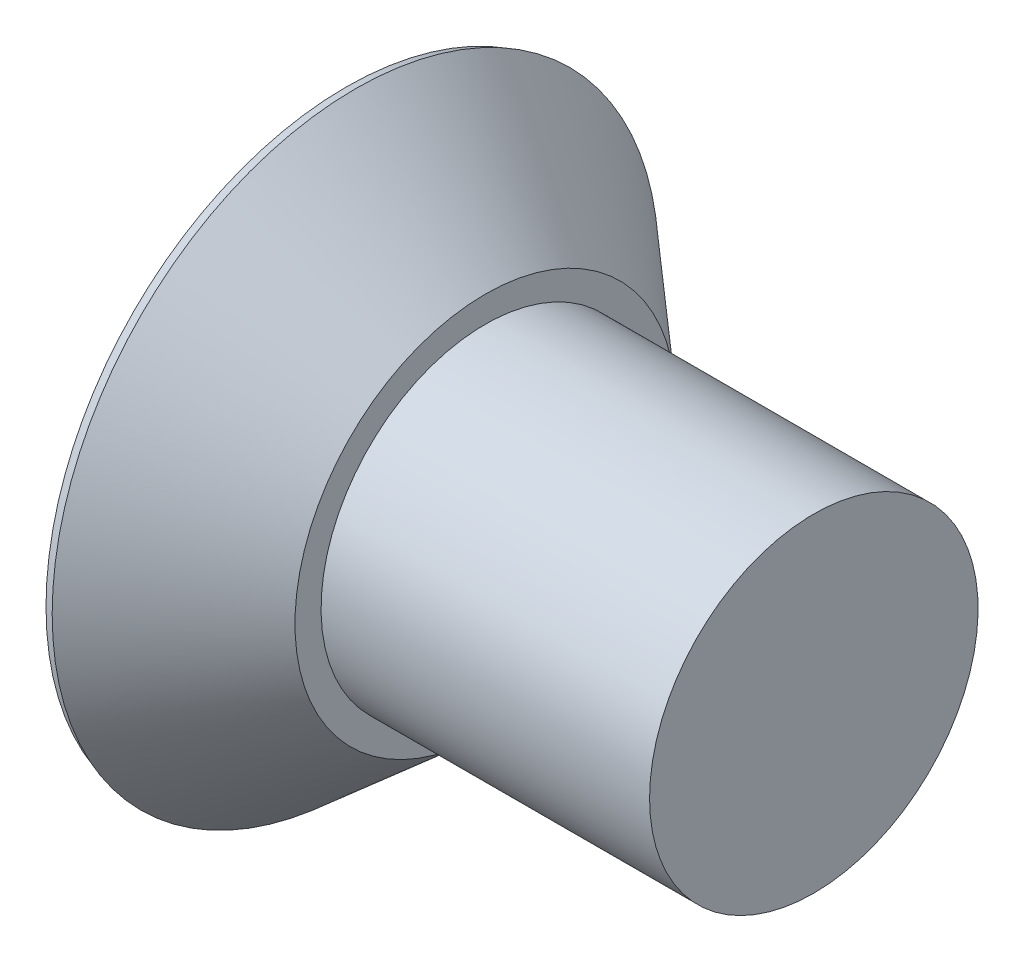
ISO-10303-21;
HEADER;
FILE_DESCRIPTION(('STEP AP214'),'2;1');
FILE_NAME('part.step','',(''),(''),'','','');
FILE_SCHEMA(('AUTOMOTIVE_DESIGN { 1 0 10303 214 1 1 1 1 }'));
ENDSEC;
DATA;
#1=APPLICATION_CONTEXT('core data for automotive mechanical design processes');
#2=APPLICATION_PROTOCOL_DEFINITION('international standard','automotive_design',2000,#1);
#3=PRODUCT_CONTEXT('',#1,'mechanical');
#4=PRODUCT('Part','Part','',(#3));
#5=PRODUCT_RELATED_PRODUCT_CATEGORY('part','',(#4));
#6=PRODUCT_DEFINITION_FORMATION('','',#4);
#7=PRODUCT_DEFINITION_CONTEXT('part definition',#1,'design');
#8=PRODUCT_DEFINITION('design','',#6,#7);
#9=PRODUCT_DEFINITION_SHAPE('','',#8);
#10=(LENGTH_UNIT() NAMED_UNIT(*) SI_UNIT(.MILLI.,.METRE.));
#11=(NAMED_UNIT(*) PLANE_ANGLE_UNIT() SI_UNIT($,.RADIAN.));
#12=(NAMED_UNIT(*) SI_UNIT($,.STERADIAN.) SOLID_ANGLE_UNIT());
#13=UNCERTAINTY_MEASURE_WITH_UNIT(LENGTH_MEASURE(1.E-05),#10,'distance_accuracy_value','');
#14=(GEOMETRIC_REPRESENTATION_CONTEXT(3) GLOBAL_UNCERTAINTY_ASSIGNED_CONTEXT((#13)) GLOBAL_UNIT_ASSIGNED_CONTEXT((#10,
#11,#12)) REPRESENTATION_CONTEXT('',''));
#15=CARTESIAN_POINT('',(0.,0.,0.));
#16=DIRECTION('',(0.,0.,1.));
#17=DIRECTION('',(1.,0.,0.));
#18=AXIS2_PLACEMENT_3D('',#15,#16,#17);
#19=CARTESIAN_POINT('',(-3.175,0.,0.));
#20=DIRECTION('',(1.,0.,0.));
#21=DIRECTION('',(0.,1.,0.));
#22=AXIS2_PLACEMENT_3D('',#19,#20,#21);
#23=PLANE('',#22);
#24=CARTESIAN_POINT('',(-3.175,0.,0.));
#25=DIRECTION('',(1.,0.,0.));
#26=DIRECTION('',(0.,1.,0.));
#27=AXIS2_PLACEMENT_3D('',#24,#25,#26);
#28=CIRCLE('',#27,2.89962612785746);
#29=CARTESIAN_POINT('',(-3.175,2.89962612785746,0.));
#30=VERTEX_POINT('',#29);
#31=EDGE_CURVE('E57',#30,#30,#28,.F.);
#32=ORIENTED_EDGE('',*,*,#31,.T.);
#33=EDGE_LOOP('',(#32));
#34=FACE_BOUND('',#33,.T.);
#35=CARTESIAN_POINT('',(-3.175,0.,0.));
#36=DIRECTION('',(-1.,0.,0.));
#37=DIRECTION('',(0.,-1.,0.));
#38=AXIS2_PLACEMENT_3D('',#35,#36,#37);
#39=CIRCLE('',#38,1.68051446377314);
#40=CARTESIAN_POINT('',(-3.175,0.401320000000001,1.6318918838424));
#41=VERTEX_POINT('',#40);
#42=CARTESIAN_POINT('',(-3.175,-0.401320000000006,1.6318918838424));
#43=VERTEX_POINT('',#42);
#44=EDGE_CURVE('E264',#41,#43,#39,.F.);
#45=ORIENTED_EDGE('',*,*,#44,.T.);
#46=DIRECTION('',(0.,0.,1.));
#47=VECTOR('',#46,1.);
#48=CARTESIAN_POINT('',(-3.175,-0.401320000000007,1.96605844714749));
#49=LINE('',#48,#47);
#50=CARTESIAN_POINT('',(-3.175,-0.401320000000005,1.18368922357374));
#51=VERTEX_POINT('',#50);
#52=EDGE_CURVE('E232',#51,#43,#49,.T.);
#53=ORIENTED_EDGE('',*,*,#52,.F.);
#54=DIRECTION('',(0.,0.382683432365087,0.923879532511288));
#55=VECTOR('',#54,1.);
#56=CARTESIAN_POINT('',(-3.175,-0.401320000000005,1.18368922357374));
#57=LINE('',#56,#55);
#58=CARTESIAN_POINT('',(-3.175,-0.630470640193098,0.630470640193096));
#59=VERTEX_POINT('',#58);
#60=EDGE_CURVE('E227',#59,#51,#57,.T.);
#61=ORIENTED_EDGE('',*,*,#60,.F.);
#62=DIRECTION('',(0.,0.923879532511285,0.382683432365094));
#63=VECTOR('',#62,1.);
#64=CARTESIAN_POINT('',(-3.175,-0.630470640193098,0.630470640193096));
#65=LINE('',#64,#63);
#66=CARTESIAN_POINT('',(-3.175,-1.18368922357375,0.401319999999997));
#67=VERTEX_POINT('',#66);
#68=EDGE_CURVE('E240',#67,#59,#65,.T.);
#69=ORIENTED_EDGE('',*,*,#68,.F.);
#70=DIRECTION('',(0.,1.,0.));
#71=VECTOR('',#70,1.);
#72=CARTESIAN_POINT('',(-3.175,-1.18368922357375,0.401319999999997));
#73=LINE('',#72,#71);
#74=CARTESIAN_POINT('',(-3.175,-1.6318918838424,0.401319999999996));
#75=VERTEX_POINT('',#74);
#76=EDGE_CURVE('E236',#75,#67,#73,.T.);
#77=ORIENTED_EDGE('',*,*,#76,.F.);
#78=CARTESIAN_POINT('',(-3.175,0.,0.));
#79=DIRECTION('',(-1.,0.,0.));
#80=DIRECTION('',(0.,-1.,0.));
#81=AXIS2_PLACEMENT_3D('',#78,#79,#80);
#82=CIRCLE('',#81,1.68051446377314);
#83=CARTESIAN_POINT('',(-3.175,-1.6318918838424,-0.40132));
#84=VERTEX_POINT('',#83);
#85=EDGE_CURVE('E245',#75,#84,#82,.F.);
#86=ORIENTED_EDGE('',*,*,#85,.T.);
#87=DIRECTION('',(0.,-1.,0.));
#88=VECTOR('',#87,1.);
#89=CARTESIAN_POINT('',(-3.175,-1.96605844714749,-0.40132));
#90=LINE('',#89,#88);
#91=CARTESIAN_POINT('',(-3.175,-1.18368922357375,-0.40132));
#92=VERTEX_POINT('',#91);
#93=EDGE_CURVE('E211',#92,#84,#90,.T.);
#94=ORIENTED_EDGE('',*,*,#93,.F.);
#95=DIRECTION('',(0.,-0.923879532511287,0.38268343236509));
#96=VECTOR('',#95,1.);
#97=CARTESIAN_POINT('',(-3.175,-1.18368922357375,-0.40132));
#98=LINE('',#97,#96);
#99=CARTESIAN_POINT('',(-3.175,-0.630470640193099,-0.630470640193096));
#100=VERTEX_POINT('',#99);
#101=EDGE_CURVE('E207',#100,#92,#98,.T.);
#102=ORIENTED_EDGE('',*,*,#101,.F.);
#103=DIRECTION('',(0.,-0.38268343236509,0.923879532511287));
#104=VECTOR('',#103,1.);
#105=CARTESIAN_POINT('',(-3.175,-0.630470640193099,-0.630470640193096));
#106=LINE('',#105,#104);
#107=CARTESIAN_POINT('',(-3.175,-0.401320000000002,-1.18368922357374));
#108=VERTEX_POINT('',#107);
#109=EDGE_CURVE('E220',#108,#100,#106,.T.);
#110=ORIENTED_EDGE('',*,*,#109,.F.);
#111=DIRECTION('',(0.,0.,1.));
#112=VECTOR('',#111,1.);
#113=CARTESIAN_POINT('',(-3.175,-0.401320000000002,-1.18368922357374));
#114=LINE('',#113,#112);
#115=CARTESIAN_POINT('',(-3.175,-0.401320000000002,-1.6318918838424));
#116=VERTEX_POINT('',#115);
#117=EDGE_CURVE('E216',#116,#108,#114,.T.);
#118=ORIENTED_EDGE('',*,*,#117,.F.);
#119=CARTESIAN_POINT('',(-3.175,0.,0.));
#120=DIRECTION('',(-1.,0.,0.));
#121=DIRECTION('',(0.,-1.,0.));
#122=AXIS2_PLACEMENT_3D('',#119,#120,#121);
#123=CIRCLE('',#122,1.68051446377314);
#124=CARTESIAN_POINT('',(-3.175,0.401320000000016,-1.6318918838424));
#125=VERTEX_POINT('',#124);
#126=EDGE_CURVE('E197',#116,#125,#123,.F.);
#127=ORIENTED_EDGE('',*,*,#126,.T.);
#128=DIRECTION('',(0.,0.,-1.));
#129=VECTOR('',#128,1.);
#130=CARTESIAN_POINT('',(-3.175,0.40132000000002,-1.96605844714749));
#131=LINE('',#130,#129);
#132=CARTESIAN_POINT('',(-3.175,0.401320000000012,-1.18368922357374));
#133=VERTEX_POINT('',#132);
#134=EDGE_CURVE('E176',#133,#125,#131,.T.);
#135=ORIENTED_EDGE('',*,*,#134,.F.);
#136=DIRECTION('',(0.,-0.38268343236508,-0.923879532511291));
#137=VECTOR('',#136,1.);
#138=CARTESIAN_POINT('',(-3.175,0.401320000000012,-1.18368922357374));
#139=LINE('',#138,#137);
#140=CARTESIAN_POINT('',(-3.175,0.630470640193102,-0.630470640193091));
#141=VERTEX_POINT('',#140);
#142=EDGE_CURVE('E186',#141,#133,#139,.T.);
#143=ORIENTED_EDGE('',*,*,#142,.F.);
#144=DIRECTION('',(0.,-0.923879532511283,-0.3826834323651));
#145=VECTOR('',#144,1.);
#146=CARTESIAN_POINT('',(-3.175,0.630470640193102,-0.630470640193091));
#147=LINE('',#146,#145);
#148=CARTESIAN_POINT('',(-3.175,1.18368922357375,-0.401319999999989));
#149=VERTEX_POINT('',#148);
#150=EDGE_CURVE('E183',#149,#141,#147,.T.);
#151=ORIENTED_EDGE('',*,*,#150,.F.);
#152=DIRECTION('',(0.,-1.,0.));
#153=VECTOR('',#152,1.);
#154=CARTESIAN_POINT('',(-3.175,1.18368922357375,-0.401319999999989));
#155=LINE('',#154,#153);
#156=CARTESIAN_POINT('',(-3.175,1.63189188384241,-0.401319999999984));
#157=VERTEX_POINT('',#156);
#158=EDGE_CURVE('E199',#157,#149,#155,.T.);
#159=ORIENTED_EDGE('',*,*,#158,.F.);
#160=CARTESIAN_POINT('',(-3.175,1.6318918838424,0.40132));
#161=VERTEX_POINT('',#160);
#162=EDGE_CURVE('E268',#157,#161,#39,.F.);
#163=ORIENTED_EDGE('',*,*,#162,.T.);
#164=DIRECTION('',(0.,1.,0.));
#165=VECTOR('',#164,1.);
#166=CARTESIAN_POINT('',(-3.175,1.96605844714749,0.40132));
#167=LINE('',#166,#165);
#168=CARTESIAN_POINT('',(-3.175,1.18368922357375,0.40132));
#169=VERTEX_POINT('',#168);
#170=EDGE_CURVE('E65',#169,#161,#167,.T.);
#171=ORIENTED_EDGE('',*,*,#170,.F.);
#172=DIRECTION('',(0.,0.923879532511287,-0.38268343236509));
#173=VECTOR('',#172,1.);
#174=CARTESIAN_POINT('',(-3.175,1.18368922357375,0.40132));
#175=LINE('',#174,#173);
#176=CARTESIAN_POINT('',(-3.175,0.630470640193097,0.630470640193096));
#177=VERTEX_POINT('',#176);
#178=EDGE_CURVE('E249',#177,#169,#175,.T.);
#179=ORIENTED_EDGE('',*,*,#178,.F.);
#180=DIRECTION('',(0.,0.38268343236509,-0.923879532511287));
#181=VECTOR('',#180,1.);
#182=CARTESIAN_POINT('',(-3.175,0.630470640193097,0.630470640193096));
#183=LINE('',#182,#181);
#184=CARTESIAN_POINT('',(-3.175,0.401320000000001,1.18368922357374));
#185=VERTEX_POINT('',#184);
#186=EDGE_CURVE('E259',#185,#177,#183,.T.);
#187=ORIENTED_EDGE('',*,*,#186,.F.);
#188=DIRECTION('',(0.,0.,-1.));
#189=VECTOR('',#188,1.);
#190=CARTESIAN_POINT('',(-3.175,0.401320000000001,1.18368922357374));
#191=LINE('',#190,#189);
#192=EDGE_CURVE('E256',#41,#185,#191,.T.);
#193=ORIENTED_EDGE('',*,*,#192,.F.);
#194=EDGE_LOOP('',(#45,#53,#61,#69,#77,#86,#94,#102,#110,#118,#127,#135,#143,#151,#159,#163,
#171,#179,#187,#193));
#195=FACE_BOUND('',#194,.T.);
#196=ADVANCED_FACE('F46',(#34,#195),#23,.F.);
#197=CARTESIAN_POINT('',(-3.175,0.,0.));
#198=DIRECTION('',(-1.,0.,0.));
#199=DIRECTION('',(0.,-1.,0.));
#200=AXIS2_PLACEMENT_3D('',#197,#198,#199);
#201=CYLINDRICAL_SURFACE('',#200,1.5875);
#202=CARTESIAN_POINT('',(1.3462,0.,0.));
#203=DIRECTION('',(-1.,0.,0.));
#204=DIRECTION('',(0.,0.,1.));
#205=AXIS2_PLACEMENT_3D('',#202,#203,#204);
#206=CIRCLE('',#205,1.5875);
#207=CARTESIAN_POINT('',(1.3462,0.,1.5875));
#208=VERTEX_POINT('',#207);
#209=EDGE_CURVE('E50',#208,#208,#206,.T.);
#210=ORIENTED_EDGE('',*,*,#209,.T.);
#211=EDGE_LOOP('',(#210));
#212=FACE_BOUND('',#211,.T.);
#213=CARTESIAN_POINT('',(-1.8288,0.,0.));
#214=DIRECTION('',(-1.,0.,0.));
#215=DIRECTION('',(0.,-1.,0.));
#216=AXIS2_PLACEMENT_3D('',#213,#214,#215);
#217=CIRCLE('',#216,1.5875);
#218=CARTESIAN_POINT('',(-1.8288,-1.5875,0.));
#219=VERTEX_POINT('',#218);
#220=EDGE_CURVE('E272',#219,#219,#217,.T.);
#221=ORIENTED_EDGE('',*,*,#220,.F.);
#222=EDGE_LOOP('',(#221));
#223=FACE_BOUND('',#222,.T.);
#224=ADVANCED_FACE('F432',(#212,#223),#201,.T.);
#225=CARTESIAN_POINT('',(-1.8288,1.5875,0.));
#226=DIRECTION('',(-1.,0.,0.));
#227=DIRECTION('',(0.,-1.,0.));
#228=AXIS2_PLACEMENT_3D('',#225,#226,#227);
#229=PLANE('',#228);
#230=CARTESIAN_POINT('',(-1.8288,0.,0.));
#231=DIRECTION('',(-1.,0.,0.));
#232=DIRECTION('',(0.,-1.,0.));
#233=AXIS2_PLACEMENT_3D('',#230,#231,#232);
#234=CIRCLE('',#233,1.83966619355179);
#235=CARTESIAN_POINT('',(-1.8288,-1.83966619355179,0.));
#236=VERTEX_POINT('',#235);
#237=EDGE_CURVE('E267',#236,#236,#234,.T.);
#238=ORIENTED_EDGE('',*,*,#237,.F.);
#239=EDGE_LOOP('',(#238));
#240=FACE_BOUND('',#239,.T.);
#241=ORIENTED_EDGE('',*,*,#220,.T.);
#242=EDGE_LOOP('',(#241));
#243=FACE_BOUND('',#242,.T.);
#244=ADVANCED_FACE('F437',(#240,#243),#229,.F.);
#245=CARTESIAN_POINT('',(-1.8288,0.,0.));
#246=DIRECTION('',(-1.,0.,0.));
#247=DIRECTION('',(0.,-1.,0.));
#248=AXIS2_PLACEMENT_3D('',#245,#246,#247);
#249=CONICAL_SURFACE('',#248,1.83966619355179,0.715584993317677);
#250=CARTESIAN_POINT('',(-3.0841359853795,0.,0.));
#251=DIRECTION('',(1.,0.,0.));
#252=DIRECTION('',(0.,1.,0.));
#253=AXIS2_PLACEMENT_3D('',#250,#251,#252);
#254=CIRCLE('',#253,2.93091311714566);
#255=CARTESIAN_POINT('',(-3.0841359853795,2.93091311714566,0.));
#256=VERTEX_POINT('',#255);
#257=EDGE_CURVE('E12',#256,#256,#254,.T.);
#258=ORIENTED_EDGE('',*,*,#257,.T.);
#259=EDGE_LOOP('',(#258));
#260=FACE_BOUND('',#259,.T.);
#261=ORIENTED_EDGE('',*,*,#237,.T.);
#262=EDGE_LOOP('',(#261));
#263=FACE_BOUND('',#262,.T.);
#264=ADVANCED_FACE('F306',(#260,#263),#249,.T.);
#265=CARTESIAN_POINT('',(-3.175,1.96605844714749,0.40132));
#266=DIRECTION('',(-0.0871557427476584,0.,-0.996194698091745));
#267=DIRECTION('',(-0.996194698091746,0.,0.0871557427476584));
#268=AXIS2_PLACEMENT_3D('',#265,#266,#267);
#269=PLANE('',#268);
#270=CARTESIAN_POINT('',(-3.175,1.6318918838424,0.40132));
#271=CARTESIAN_POINT('',(-3.1314798976619,1.59386894434932,0.397512484409928));
#272=CARTESIAN_POINT('',(-3.0879722876984,1.55583158396753,0.393706061761014));
#273=CARTESIAN_POINT('',(-3.00098992901027,1.47971913424589,0.386096091449057));
#274=CARTESIAN_POINT('',(-2.95751518024463,1.44164404495327,0.382292543782426));
#275=CARTESIAN_POINT('',(-2.87060628831762,1.36544713480172,0.374689000979213));
#276=CARTESIAN_POINT('',(-2.82717214517802,1.32732531391776,0.370889005844536));
#277=CARTESIAN_POINT('',(-2.74035728364561,1.25102031988488,0.363293689634877));
#278=CARTESIAN_POINT('',(-2.69697656532016,1.21283714665874,0.359498368565789));
#279=CARTESIAN_POINT('',(-2.65362901203753,1.17461602471587,0.355705949061973));
#280=B_SPLINE_CURVE_WITH_KNOTS('',3,(#270,#271,#272,#273,#274,#275,#276,#277,#278,#279),
.UNSPECIFIED.,.F.,.F.,(4,2,2,2,4),(0.,0.173747422088549,0.3474946270213,0.52124192511289,
0.694989442064245),.UNSPECIFIED.);
#281=CARTESIAN_POINT('',(-2.65362901203752,1.17461602471589,0.355705949061972));
#282=VERTEX_POINT('',#281);
#283=EDGE_CURVE('E115',#161,#282,#280,.T.);
#284=ORIENTED_EDGE('',*,*,#283,.T.);
#285=DIRECTION('',(-0.996045029063886,0.0173337504938601,0.0871426484044397));
#286=VECTOR('',#285,1.);
#287=CARTESIAN_POINT('',(-3.18850775800067,1.18392429337489,0.40250177569471));
#288=LINE('',#287,#286);
#289=EDGE_CURVE('E263',#282,#169,#288,.T.);
#290=ORIENTED_EDGE('',*,*,#289,.T.);
#291=ORIENTED_EDGE('',*,*,#170,.T.);
#292=EDGE_LOOP('',(#284,#290,#291));
#293=FACE_BOUND('',#292,.T.);
#294=ADVANCED_FACE('F446',(#293),#269,.T.);
#295=CARTESIAN_POINT('',(-3.175,0.401320000000001,1.18368922357374));
#296=DIRECTION('',(-0.0871557427476582,-0.996194698091746,0.));
#297=DIRECTION('',(0.996194698091746,-0.0871557427476582,0.));
#298=AXIS2_PLACEMENT_3D('',#295,#296,#297);
#299=PLANE('',#298);
#300=CARTESIAN_POINT('',(-2.65362901203752,0.355705949061973,1.17461602471589));
#301=CARTESIAN_POINT('',(-2.69697656532016,0.35949836856579,1.21283714665875));
#302=CARTESIAN_POINT('',(-2.74035728364561,0.363293689634878,1.25102031988488));
#303=CARTESIAN_POINT('',(-2.82717214517802,0.370889005844537,1.32732531391776));
#304=CARTESIAN_POINT('',(-2.87060628831762,0.374689000979214,1.36544713480172));
#305=CARTESIAN_POINT('',(-2.95751518024463,0.382292543782427,1.44164404495327));
#306=CARTESIAN_POINT('',(-3.00098992901027,0.386096091449058,1.47971913424589));
#307=CARTESIAN_POINT('',(-3.0879722876984,0.393706061761015,1.55583158396753));
#308=CARTESIAN_POINT('',(-3.1314798976619,0.397512484409929,1.59386894434932));
#309=CARTESIAN_POINT('',(-3.175,0.401320000000001,1.6318918838424));
#310=B_SPLINE_CURVE_WITH_KNOTS('',3,(#300,#301,#302,#303,#304,#305,#306,#307,#308,#309),
.UNSPECIFIED.,.F.,.F.,(4,2,2,2,4),(0.,0.173747516951355,0.347494815042944,0.521242019975695,
0.694989442064244),.UNSPECIFIED.);
#311=CARTESIAN_POINT('',(-2.65362901203752,0.355705949061973,1.17461602471589));
#312=VERTEX_POINT('',#311);
#313=EDGE_CURVE('E122',#312,#41,#310,.T.);
#314=ORIENTED_EDGE('',*,*,#313,.T.);
#315=ORIENTED_EDGE('',*,*,#192,.T.);
#316=DIRECTION('',(-0.996045029063886,0.0871426484044395,0.0173337504938603));
#317=VECTOR('',#316,1.);
#318=CARTESIAN_POINT('',(-3.18533839039051,0.402224491958276,1.18386913821044));
#319=LINE('',#318,#317);
#320=EDGE_CURVE('E470',#312,#185,#319,.T.);
#321=ORIENTED_EDGE('',*,*,#320,.F.);
#322=EDGE_LOOP('',(#314,#315,#321));
#323=FACE_BOUND('',#322,.T.);
#324=ADVANCED_FACE('F424',(#323),#299,.T.);
#325=CARTESIAN_POINT('',(-3.175,0.630470640193097,0.630470640193096));
#326=DIRECTION('',(-0.0871557427476582,-0.920363891963224,-0.381227206369654));
#327=DIRECTION('',(0.,0.38268343236509,-0.923879532511287));
#328=AXIS2_PLACEMENT_3D('',#325,#326,#327);
#329=PLANE('',#328);
#330=CARTESIAN_POINT('',(-2.15653261900834,0.562273123193877,0.562273123193875));
#331=CARTESIAN_POINT('',(-2.16855532913495,0.55378212950972,0.585520814010875));
#332=CARTESIAN_POINT('',(-2.18150564901106,0.545551992492285,0.608350810241366));
#333=CARTESIAN_POINT('',(-2.20886179795181,0.529547128508956,0.653244102482136));
#334=CARTESIAN_POINT('',(-2.22326556548696,0.521771780553955,0.675308426388146));
#335=CARTESIAN_POINT('',(-2.2531118653499,0.506613685551937,0.718726733022797));
#336=CARTESIAN_POINT('',(-2.26855054901068,0.499229648817688,0.740082949453847));
#337=CARTESIAN_POINT('',(-2.30027419067009,0.484758461086384,0.782272111046905));
#338=CARTESIAN_POINT('',(-2.31655948365134,0.477671429641328,0.803104844168216));
#339=CARTESIAN_POINT('',(-2.36619494171746,0.456858452675646,0.864699419018889));
#340=CARTESIAN_POINT('',(-2.4005035501924,0.44349359094654,0.904808645630581));
#341=CARTESIAN_POINT('',(-2.47076930639185,0.417421625716889,0.98381601723977));
#342=CARTESIAN_POINT('',(-2.50672776481034,0.404715062868061,1.02271315663797));
#343=CARTESIAN_POINT('',(-2.56137986263805,0.386054141614538,1.08025910804137));
#344=CARTESIAN_POINT('',(-2.57965641743674,0.379919407415052,1.09924803231381));
#345=CARTESIAN_POINT('',(-2.61646613107091,0.36774399331997,1.13705747821404));
#346=CARTESIAN_POINT('',(-2.63499959580526,0.361703447750496,1.15587774548414));
#347=CARTESIAN_POINT('',(-2.65362901203752,0.355705949061975,1.17461602471588));
#348=B_SPLINE_CURVE_WITH_KNOTS('',3,(#330,#331,#332,#333,#334,#335,#336,#337,#338,#339,#340,
#341,#342,#343,#344,#345,#346,#347),.UNSPECIFIED.,.F.,.F.,(4,2,2,2,2,2,2,2,4),(0.,
0.0824858618389932,0.164856330063325,0.246935861286525,0.329048120295827,0.492313680001672,
0.655711268258,0.736889852640143,0.818175213659009),.UNSPECIFIED.);
#349=CARTESIAN_POINT('',(-2.15653261900834,0.562273123193877,0.562273123193875));
#350=VERTEX_POINT('',#349);
#351=EDGE_CURVE('E409',#350,#312,#348,.T.);
#352=ORIENTED_EDGE('',*,*,#351,.T.);
#353=ORIENTED_EDGE('',*,*,#320,.T.);
#354=ORIENTED_EDGE('',*,*,#186,.T.);
#355=DIRECTION('',(-0.995546167269401,0.0666626913468322,0.0666626913468324));
#356=VECTOR('',#355,1.);
#357=CARTESIAN_POINT('',(-3.19650702404905,0.631910770398111,0.63191077039811));
#358=LINE('',#357,#356);
#359=EDGE_CURVE('E468',#350,#177,#358,.T.);
#360=ORIENTED_EDGE('',*,*,#359,.F.);
#361=EDGE_LOOP('',(#352,#353,#354,#360));
#362=FACE_BOUND('',#361,.T.);
#363=ADVANCED_FACE('F421',(#362),#329,.T.);
#364=CARTESIAN_POINT('',(-3.175,1.18368922357375,0.40132));
#365=DIRECTION('',(-0.0871557427476583,-0.381227206369654,-0.920363891963224));
#366=DIRECTION('',(0.,0.923879532511287,-0.38268343236509));
#367=AXIS2_PLACEMENT_3D('',#364,#365,#366);
#368=PLANE('',#367);
#369=CARTESIAN_POINT('',(-2.65362901203752,1.17461602471589,0.355705949061972));
#370=CARTESIAN_POINT('',(-2.63017740990551,1.15102691913902,0.3632560790465));
#371=CARTESIAN_POINT('',(-2.60687858977536,1.12730964446808,0.370873766412486));
#372=CARTESIAN_POINT('',(-2.5606686627932,1.07955603898917,0.386278013826098));
#373=CARTESIAN_POINT('',(-2.53775754602743,1.05551971636755,0.394064569544029));
#374=CARTESIAN_POINT('',(-2.46994788717799,0.983072092680608,0.417651983384761));
#375=CARTESIAN_POINT('',(-2.42574322411196,0.934093764743364,0.433753420022102));
#376=CARTESIAN_POINT('',(-2.36172177643157,0.858822131165735,0.458869309471011));
#377=CARTESIAN_POINT('',(-2.34072465951698,0.833381027495731,0.467418994685237));
#378=CARTESIAN_POINT('',(-2.29982305899086,0.781789765221477,0.484915534431192));
#379=CARTESIAN_POINT('',(-2.2799179349171,0.755640035973815,0.493862150467716));
#380=CARTESIAN_POINT('',(-2.2414731837362,0.702313935963285,0.512309939910504));
#381=CARTESIAN_POINT('',(-2.22294068290752,0.675133183557768,0.521813603090106));
#382=CARTESIAN_POINT('',(-2.1879773513146,0.619611622565007,0.541500462401794));
#383=CARTESIAN_POINT('',(-2.17155098047276,0.591268514682324,0.551685033274719));
#384=CARTESIAN_POINT('',(-2.15653261900782,0.562273123194318,0.562273123193644));
#385=B_SPLINE_CURVE_WITH_KNOTS('',3,(#369,#370,#371,#372,#373,#374,#375,#376,#377,#378,#379,
#380,#381,#382,#383,#384),.UNSPECIFIED.,.F.,.F.,(4,2,2,2,2,2,2,4),(0.,0.102322744464749,
0.204642868523216,0.408287240815811,0.510497040795033,0.61264623856581,0.715293179384893,
0.818154015432559),.UNSPECIFIED.);
#386=EDGE_CURVE('E112',#282,#350,#385,.T.);
#387=ORIENTED_EDGE('',*,*,#386,.T.);
#388=ORIENTED_EDGE('',*,*,#359,.T.);
#389=ORIENTED_EDGE('',*,*,#178,.T.);
#390=ORIENTED_EDGE('',*,*,#289,.F.);
#391=EDGE_LOOP('',(#387,#388,#389,#390));
#392=FACE_BOUND('',#391,.T.);
#393=ADVANCED_FACE('F303',(#392),#368,.T.);
#394=CARTESIAN_POINT('',(-2.48702402378618,0.,0.));
#395=DIRECTION('',(-1.,0.,0.));
#396=DIRECTION('',(0.,-1.,0.));
#397=AXIS2_PLACEMENT_3D('',#394,#395,#396);
#398=CONICAL_SURFACE('',#397,1.08246607171428,0.715584993317677);
#399=CARTESIAN_POINT('',(-1.24178925299744,0.,0.));
#400=VERTEX_POINT('',#399);
#401=VERTEX_LOOP('',#400);
#402=FACE_BOUND('',#401,.T.);
#403=ORIENTED_EDGE('',*,*,#162,.F.);
#404=CARTESIAN_POINT('',(-2.65362901203752,1.17461602471589,-0.355705949061961));
#405=CARTESIAN_POINT('',(-2.69697656532016,1.21283714665875,-0.359498368565777));
#406=CARTESIAN_POINT('',(-2.74035728364561,1.25102031988489,-0.363293689634865));
#407=CARTESIAN_POINT('',(-2.82717214517802,1.32732531391776,-0.370889005844523));
#408=CARTESIAN_POINT('',(-2.87060628831762,1.36544713480173,-0.3746890009792));
#409=CARTESIAN_POINT('',(-2.95751518024463,1.44164404495327,-0.382292543782413));
#410=CARTESIAN_POINT('',(-3.00098992901027,1.4797191342459,-0.386096091449043));
#411=CARTESIAN_POINT('',(-3.0879722876984,1.55583158396753,-0.393706061761));
#412=CARTESIAN_POINT('',(-3.1314798976619,1.59386894434933,-0.397512484409913));
#413=CARTESIAN_POINT('',(-3.175,1.63189188384241,-0.401319999999984));
#414=B_SPLINE_CURVE_WITH_KNOTS('',3,(#404,#405,#406,#407,#408,#409,#410,#411,#412,#413),
.UNSPECIFIED.,.F.,.F.,(4,2,2,2,4),(0.,0.173747516951355,0.347494815042944,0.521242019975695,
0.694989442064245),.UNSPECIFIED.);
#415=CARTESIAN_POINT('',(-2.65362901203752,1.17461602471589,-0.355705949061961));
#416=VERTEX_POINT('',#415);
#417=EDGE_CURVE('E288',#416,#157,#414,.T.);
#418=ORIENTED_EDGE('',*,*,#417,.F.);
#419=CARTESIAN_POINT('',(-2.15653261900834,0.562273123193881,-0.562273123193872));
#420=CARTESIAN_POINT('',(-2.16855532913495,0.585520814010881,-0.553782129509714));
#421=CARTESIAN_POINT('',(-2.18150564901106,0.608350810241371,-0.545551992492279));
#422=CARTESIAN_POINT('',(-2.20886179795181,0.653244102482141,-0.529547128508949));
#423=CARTESIAN_POINT('',(-2.22326556548696,0.675308426388152,-0.521771780553948));
#424=CARTESIAN_POINT('',(-2.2531118653499,0.718726733022803,-0.50661368555193));
#425=CARTESIAN_POINT('',(-2.26855054901068,0.740082949453852,-0.49922964881768));
#426=CARTESIAN_POINT('',(-2.30027419067009,0.78227211104691,-0.484758461086376));
#427=CARTESIAN_POINT('',(-2.31655948365134,0.80310484416822,-0.47767142964132));
#428=CARTESIAN_POINT('',(-2.36619494171746,0.864699419018893,-0.456858452675638));
#429=CARTESIAN_POINT('',(-2.4005035501924,0.904808645630585,-0.443493590946531));
#430=CARTESIAN_POINT('',(-2.47076930639185,0.983816017239774,-0.417421625716879));
#431=CARTESIAN_POINT('',(-2.50672776481034,1.02271315663797,-0.404715062868051));
#432=CARTESIAN_POINT('',(-2.56137986263805,1.08025910804138,-0.386054141614527));
#433=CARTESIAN_POINT('',(-2.57965641743674,1.09924803231382,-0.379919407415041));
#434=CARTESIAN_POINT('',(-2.61646613107091,1.13705747821404,-0.367743993319959));
#435=CARTESIAN_POINT('',(-2.63499959580526,1.15587774548415,-0.361703447750484));
#436=CARTESIAN_POINT('',(-2.65362901203752,1.17461602471588,-0.355705949061963));
#437=B_SPLINE_CURVE_WITH_KNOTS('',3,(#419,#420,#421,#422,#423,#424,#425,#426,#427,#428,#429,
#430,#431,#432,#433,#434,#435,#436),.UNSPECIFIED.,.F.,.F.,(4,2,2,2,2,2,2,2,4),(0.,
0.0824858618389934,0.164856330063325,0.246935861286526,0.329048120295826,0.492313680001671,
0.655711268257999,0.736889852640142,0.818175213659008),.UNSPECIFIED.);
#438=CARTESIAN_POINT('',(-2.15653261900834,0.562273123193881,-0.562273123193872));
#439=VERTEX_POINT('',#438);
#440=EDGE_CURVE('E323',#439,#416,#437,.T.);
#441=ORIENTED_EDGE('',*,*,#440,.F.);
#442=CARTESIAN_POINT('',(-2.65362901203752,0.355705949061984,-1.17461602471588));
#443=CARTESIAN_POINT('',(-2.63017740990551,0.363256079046512,-1.15102691913902));
#444=CARTESIAN_POINT('',(-2.60687858977536,0.370873766412498,-1.12730964446808));
#445=CARTESIAN_POINT('',(-2.5606686627932,0.386278013826109,-1.07955603898917));
#446=CARTESIAN_POINT('',(-2.53775754602743,0.39406456954404,-1.05551971636754));
#447=CARTESIAN_POINT('',(-2.46994788717799,0.417651983384771,-0.983072092680604));
#448=CARTESIAN_POINT('',(-2.42574322411196,0.433753420022112,-0.93409376474336));
#449=CARTESIAN_POINT('',(-2.36172177643157,0.45886930947102,-0.85882213116573));
#450=CARTESIAN_POINT('',(-2.34072465951698,0.467418994685245,-0.833381027495727));
#451=CARTESIAN_POINT('',(-2.29982305899086,0.4849155344312,-0.781789765221473));
#452=CARTESIAN_POINT('',(-2.2799179349171,0.493862150467724,-0.75564003597381));
#453=CARTESIAN_POINT('',(-2.2414731837362,0.512309939910511,-0.70231393596328));
#454=CARTESIAN_POINT('',(-2.22294068290752,0.521813603090112,-0.675133183557763));
#455=CARTESIAN_POINT('',(-2.1879773513146,0.5415004624018,-0.619611622565002));
#456=CARTESIAN_POINT('',(-2.17155098047276,0.551685033274725,-0.591268514682319));
#457=CARTESIAN_POINT('',(-2.15653261900782,0.562273123193649,-0.562273123194312));
#458=B_SPLINE_CURVE_WITH_KNOTS('',3,(#442,#443,#444,#445,#446,#447,#448,#449,#450,#451,#452,
#453,#454,#455,#456,#457),.UNSPECIFIED.,.F.,.F.,(4,2,2,2,2,2,2,4),(0.,0.102322744464749,
0.204642868523217,0.408287240815812,0.510497040795033,0.612646238565811,0.715293179384893,
0.81815401543256),.UNSPECIFIED.);
#459=CARTESIAN_POINT('',(-2.65362901203752,0.355705949061984,-1.17461602471588));
#460=VERTEX_POINT('',#459);
#461=EDGE_CURVE('E212',#460,#439,#458,.T.);
#462=ORIENTED_EDGE('',*,*,#461,.F.);
#463=CARTESIAN_POINT('',(-3.175,0.401320000000016,-1.6318918838424));
#464=CARTESIAN_POINT('',(-3.1314798976619,0.397512484409944,-1.59386894434932));
#465=CARTESIAN_POINT('',(-3.0879722876984,0.39370606176103,-1.55583158396753));
#466=CARTESIAN_POINT('',(-3.00098992901027,0.386096091449072,-1.47971913424589));
#467=CARTESIAN_POINT('',(-2.95751518024463,0.382292543782441,-1.44164404495326));
#468=CARTESIAN_POINT('',(-2.87060628831762,0.374689000979227,-1.36544713480172));
#469=CARTESIAN_POINT('',(-2.82717214517802,0.370889005844549,-1.32732531391776));
#470=CARTESIAN_POINT('',(-2.74035728364561,0.36329368963489,-1.25102031988488));
#471=CARTESIAN_POINT('',(-2.69697656532016,0.359498368565801,-1.21283714665874));
#472=CARTESIAN_POINT('',(-2.65362901203753,0.355705949061984,-1.17461602471587));
#473=B_SPLINE_CURVE_WITH_KNOTS('',3,(#463,#464,#465,#466,#467,#468,#469,#470,#471,#472),
.UNSPECIFIED.,.F.,.F.,(4,2,2,2,4),(0.,0.17374742208855,0.347494627021301,0.52124192511289,
0.694989442064245),.UNSPECIFIED.);
#474=EDGE_CURVE('E178',#125,#460,#473,.T.);
#475=ORIENTED_EDGE('',*,*,#474,.F.);
#476=ORIENTED_EDGE('',*,*,#126,.F.);
#477=CARTESIAN_POINT('',(-2.65362901203752,-0.355705949061974,-1.17461602471589));
#478=CARTESIAN_POINT('',(-2.69697656532016,-0.359498368565791,-1.21283714665875));
#479=CARTESIAN_POINT('',(-2.74035728364561,-0.363293689634879,-1.25102031988488));
#480=CARTESIAN_POINT('',(-2.82717214517802,-0.370889005844538,-1.32732531391776));
#481=CARTESIAN_POINT('',(-2.87060628831762,-0.374689000979215,-1.36544713480172));
#482=CARTESIAN_POINT('',(-2.95751518024463,-0.382292543782429,-1.44164404495327));
#483=CARTESIAN_POINT('',(-3.00098992901027,-0.386096091449059,-1.47971913424589));
#484=CARTESIAN_POINT('',(-3.0879722876984,-0.393706061761017,-1.55583158396753));
#485=CARTESIAN_POINT('',(-3.1314798976619,-0.39751248440993,-1.59386894434932));
#486=CARTESIAN_POINT('',(-3.175,-0.401320000000002,-1.6318918838424));
#487=B_SPLINE_CURVE_WITH_KNOTS('',3,(#477,#478,#479,#480,#481,#482,#483,#484,#485,#486),
.UNSPECIFIED.,.F.,.F.,(4,2,2,2,4),(0.,0.173747516951355,0.347494815042944,0.521242019975695,
0.694989442064243),.UNSPECIFIED.);
#488=CARTESIAN_POINT('',(-2.65362901203752,-0.355705949061974,-1.17461602471589));
#489=VERTEX_POINT('',#488);
#490=EDGE_CURVE('E348',#489,#116,#487,.T.);
#491=ORIENTED_EDGE('',*,*,#490,.F.);
#492=CARTESIAN_POINT('',(-2.15653261900834,-0.562273123193878,-0.562273123193875));
#493=CARTESIAN_POINT('',(-2.16855532913495,-0.553782129509721,-0.585520814010875));
#494=CARTESIAN_POINT('',(-2.18150564901107,-0.545551992492286,-0.608350810241366));
#495=CARTESIAN_POINT('',(-2.20886179795181,-0.529547128508956,-0.653244102482136));
#496=CARTESIAN_POINT('',(-2.22326556548696,-0.521771780553956,-0.675308426388146));
#497=CARTESIAN_POINT('',(-2.2531118653499,-0.506613685551938,-0.718726733022797));
#498=CARTESIAN_POINT('',(-2.26855054901068,-0.499229648817688,-0.740082949453847));
#499=CARTESIAN_POINT('',(-2.30027419067009,-0.484758461086385,-0.782272111046905));
#500=CARTESIAN_POINT('',(-2.31655948365134,-0.477671429641329,-0.803104844168216));
#501=CARTESIAN_POINT('',(-2.36619494171746,-0.456858452675647,-0.864699419018888));
#502=CARTESIAN_POINT('',(-2.4005035501924,-0.443493590946541,-0.904808645630581));
#503=CARTESIAN_POINT('',(-2.47076930639185,-0.41742162571689,-0.983816017239769));
#504=CARTESIAN_POINT('',(-2.50672776481034,-0.404715062868063,-1.02271315663797));
#505=CARTESIAN_POINT('',(-2.56137986263805,-0.386054141614539,-1.08025910804137));
#506=CARTESIAN_POINT('',(-2.57965641743674,-0.379919407415053,-1.09924803231381));
#507=CARTESIAN_POINT('',(-2.61646613107091,-0.367743993319971,-1.13705747821404));
#508=CARTESIAN_POINT('',(-2.63499959580526,-0.361703447750497,-1.15587774548414));
#509=CARTESIAN_POINT('',(-2.65362901203753,-0.355705949061976,-1.17461602471588));
#510=B_SPLINE_CURVE_WITH_KNOTS('',3,(#492,#493,#494,#495,#496,#497,#498,#499,#500,#501,#502,
#503,#504,#505,#506,#507,#508,#509),.UNSPECIFIED.,.F.,.F.,(4,2,2,2,2,2,2,2,4),(0.,
0.0824858618389936,0.164856330063325,0.246935861286525,0.329048120295826,0.492313680001671,
0.655711268257999,0.736889852640143,0.818175213659009),.UNSPECIFIED.);
#511=CARTESIAN_POINT('',(-2.15653261900834,-0.562273123193878,-0.562273123193875));
#512=VERTEX_POINT('',#511);
#513=EDGE_CURVE('E356',#512,#489,#510,.T.);
#514=ORIENTED_EDGE('',*,*,#513,.F.);
#515=CARTESIAN_POINT('',(-2.65362901203752,-1.17461602471589,-0.355705949061972));
#516=CARTESIAN_POINT('',(-2.63017740990551,-1.15102691913902,-0.3632560790465));
#517=CARTESIAN_POINT('',(-2.60687858977536,-1.12730964446808,-0.370873766412486));
#518=CARTESIAN_POINT('',(-2.5606686627932,-1.07955603898918,-0.386278013826098));
#519=CARTESIAN_POINT('',(-2.53775754602743,-1.05551971636755,-0.394064569544029));
#520=CARTESIAN_POINT('',(-2.46994788717799,-0.983072092680609,-0.417651983384761));
#521=CARTESIAN_POINT('',(-2.42574322411196,-0.934093764743365,-0.433753420022103));
#522=CARTESIAN_POINT('',(-2.36172177643157,-0.858822131165735,-0.458869309471011));
#523=CARTESIAN_POINT('',(-2.34072465951698,-0.833381027495732,-0.467418994685237));
#524=CARTESIAN_POINT('',(-2.29982305899087,-0.781789765221478,-0.484915534431192));
#525=CARTESIAN_POINT('',(-2.2799179349171,-0.755640035973815,-0.493862150467716));
#526=CARTESIAN_POINT('',(-2.2414731837362,-0.702313935963286,-0.512309939910504));
#527=CARTESIAN_POINT('',(-2.22294068290752,-0.675133183557769,-0.521813603090106));
#528=CARTESIAN_POINT('',(-2.1879773513146,-0.619611622565008,-0.541500462401795));
#529=CARTESIAN_POINT('',(-2.17155098047276,-0.591268514682325,-0.551685033274719));
#530=CARTESIAN_POINT('',(-2.15653261900783,-0.562273123194319,-0.562273123193644));
#531=B_SPLINE_CURVE_WITH_KNOTS('',3,(#515,#516,#517,#518,#519,#520,#521,#522,#523,#524,#525,
#526,#527,#528,#529,#530),.UNSPECIFIED.,.F.,.F.,(4,2,2,2,2,2,2,4),(0.,0.102322744464749,
0.204642868523216,0.408287240815812,0.510497040795033,0.612646238565811,0.715293179384894,
0.818154015432559),.UNSPECIFIED.);
#532=CARTESIAN_POINT('',(-2.65362901203752,-1.17461602471589,-0.355705949061972));
#533=VERTEX_POINT('',#532);
#534=EDGE_CURVE('E228',#533,#512,#531,.T.);
#535=ORIENTED_EDGE('',*,*,#534,.F.);
#536=CARTESIAN_POINT('',(-3.175,-1.6318918838424,-0.40132));
#537=CARTESIAN_POINT('',(-3.1314798976619,-1.59386894434933,-0.397512484409928));
#538=CARTESIAN_POINT('',(-3.0879722876984,-1.55583158396753,-0.393706061761014));
#539=CARTESIAN_POINT('',(-3.00098992901027,-1.47971913424589,-0.386096091449057));
#540=CARTESIAN_POINT('',(-2.95751518024463,-1.44164404495327,-0.382292543782427));
#541=CARTESIAN_POINT('',(-2.87060628831762,-1.36544713480172,-0.374689000979213));
#542=CARTESIAN_POINT('',(-2.82717214517802,-1.32732531391776,-0.370889005844536));
#543=CARTESIAN_POINT('',(-2.74035728364561,-1.25102031988488,-0.363293689634877));
#544=CARTESIAN_POINT('',(-2.69697656532016,-1.21283714665874,-0.359498368565789));
#545=CARTESIAN_POINT('',(-2.65362901203753,-1.17461602471588,-0.355705949061973));
#546=B_SPLINE_CURVE_WITH_KNOTS('',3,(#536,#537,#538,#539,#540,#541,#542,#543,#544,#545),
.UNSPECIFIED.,.F.,.F.,(4,2,2,2,4),(0.,0.173747422088549,0.347494627021301,0.521241925112891,
0.694989442064245),.UNSPECIFIED.);
#547=EDGE_CURVE('E339',#84,#533,#546,.T.);
#548=ORIENTED_EDGE('',*,*,#547,.F.);
#549=ORIENTED_EDGE('',*,*,#85,.F.);
#550=CARTESIAN_POINT('',(-2.65362901203752,-1.17461602471589,0.355705949061969));
#551=CARTESIAN_POINT('',(-2.69697656532016,-1.21283714665875,0.359498368565786));
#552=CARTESIAN_POINT('',(-2.74035728364561,-1.25102031988488,0.363293689634874));
#553=CARTESIAN_POINT('',(-2.82717214517802,-1.32732531391776,0.370889005844533));
#554=CARTESIAN_POINT('',(-2.87060628831762,-1.36544713480172,0.37468900097921));
#555=CARTESIAN_POINT('',(-2.95751518024463,-1.44164404495327,0.382292543782423));
#556=CARTESIAN_POINT('',(-3.00098992901027,-1.47971913424589,0.386096091449054));
#557=CARTESIAN_POINT('',(-3.0879722876984,-1.55583158396753,0.393706061761011));
#558=CARTESIAN_POINT('',(-3.1314798976619,-1.59386894434932,0.397512484409924));
#559=CARTESIAN_POINT('',(-3.175,-1.6318918838424,0.401319999999996));
#560=B_SPLINE_CURVE_WITH_KNOTS('',3,(#550,#551,#552,#553,#554,#555,#556,#557,#558,#559),
.UNSPECIFIED.,.F.,.F.,(4,2,2,2,4),(0.,0.173747516951355,0.347494815042943,0.521242019975694,
0.694989442064243),.UNSPECIFIED.);
#561=CARTESIAN_POINT('',(-2.65362901203752,-1.17461602471589,0.355705949061969));
#562=VERTEX_POINT('',#561);
#563=EDGE_CURVE('E381',#562,#75,#560,.T.);
#564=ORIENTED_EDGE('',*,*,#563,.F.);
#565=CARTESIAN_POINT('',(-2.15653261900834,-0.562273123193878,0.562273123193876));
#566=CARTESIAN_POINT('',(-2.16855532913495,-0.585520814010878,0.553782129509718));
#567=CARTESIAN_POINT('',(-2.18150564901107,-0.608350810241368,0.545551992492283));
#568=CARTESIAN_POINT('',(-2.20886179795181,-0.653244102482138,0.529547128508954));
#569=CARTESIAN_POINT('',(-2.22326556548696,-0.675308426388149,0.521771780553953));
#570=CARTESIAN_POINT('',(-2.2531118653499,-0.7187267330228,0.506613685551935));
#571=CARTESIAN_POINT('',(-2.26855054901068,-0.74008294945385,0.499229648817685));
#572=CARTESIAN_POINT('',(-2.30027419067009,-0.782272111046908,0.484758461086382));
#573=CARTESIAN_POINT('',(-2.31655948365134,-0.803104844168218,0.477671429641325));
#574=CARTESIAN_POINT('',(-2.36619494171746,-0.864699419018892,0.456858452675643));
#575=CARTESIAN_POINT('',(-2.4005035501924,-0.904808645630584,0.443493590946537));
#576=CARTESIAN_POINT('',(-2.47076930639185,-0.983816017239773,0.417421625716886));
#577=CARTESIAN_POINT('',(-2.50672776481034,-1.02271315663797,0.404715062868058));
#578=CARTESIAN_POINT('',(-2.56137986263805,-1.08025910804138,0.386054141614534));
#579=CARTESIAN_POINT('',(-2.57965641743674,-1.09924803231382,0.379919407415048));
#580=CARTESIAN_POINT('',(-2.61646613107091,-1.13705747821404,0.367743993319967));
#581=CARTESIAN_POINT('',(-2.63499959580526,-1.15587774548415,0.361703447750493));
#582=CARTESIAN_POINT('',(-2.65362901203752,-1.17461602471588,0.355705949061972));
#583=B_SPLINE_CURVE_WITH_KNOTS('',3,(#565,#566,#567,#568,#569,#570,#571,#572,#573,#574,#575,
#576,#577,#578,#579,#580,#581,#582),.UNSPECIFIED.,.F.,.F.,(4,2,2,2,2,2,2,2,4),(0.,
0.0824858618389936,0.164856330063325,0.246935861286526,0.329048120295827,0.492313680001672,
0.655711268258001,0.736889852640143,0.818175213659008),.UNSPECIFIED.);
#584=CARTESIAN_POINT('',(-2.15653261900834,-0.562273123193878,0.562273123193876));
#585=VERTEX_POINT('',#584);
#586=EDGE_CURVE('E389',#585,#562,#583,.T.);
#587=ORIENTED_EDGE('',*,*,#586,.F.);
#588=CARTESIAN_POINT('',(-2.65362901203752,-0.355705949061976,1.17461602471589));
#589=CARTESIAN_POINT('',(-2.63017740990551,-0.363256079046505,1.15102691913902));
#590=CARTESIAN_POINT('',(-2.60687858977536,-0.370873766412491,1.12730964446808));
#591=CARTESIAN_POINT('',(-2.5606686627932,-0.386278013826102,1.07955603898917));
#592=CARTESIAN_POINT('',(-2.53775754602743,-0.394064569544033,1.05551971636755));
#593=CARTESIAN_POINT('',(-2.46994788717799,-0.417651983384765,0.983072092680607));
#594=CARTESIAN_POINT('',(-2.42574322411196,-0.433753420022106,0.934093764743363));
#595=CARTESIAN_POINT('',(-2.36172177643157,-0.458869309471015,0.858822131165733));
#596=CARTESIAN_POINT('',(-2.34072465951698,-0.46741899468524,0.83338102749573));
#597=CARTESIAN_POINT('',(-2.29982305899087,-0.484915534431195,0.781789765221476));
#598=CARTESIAN_POINT('',(-2.2799179349171,-0.49386215046772,0.755640035973813));
#599=CARTESIAN_POINT('',(-2.2414731837362,-0.512309939910507,0.702313935963284));
#600=CARTESIAN_POINT('',(-2.22294068290752,-0.521813603090109,0.675133183557767));
#601=CARTESIAN_POINT('',(-2.1879773513146,-0.541500462401797,0.619611622565006));
#602=CARTESIAN_POINT('',(-2.17155098047276,-0.551685033274722,0.591268514682323));
#603=CARTESIAN_POINT('',(-2.15653261900783,-0.562273123193646,0.562273123194316));
#604=B_SPLINE_CURVE_WITH_KNOTS('',3,(#588,#589,#590,#591,#592,#593,#594,#595,#596,#597,#598,
#599,#600,#601,#602,#603),.UNSPECIFIED.,.F.,.F.,(4,2,2,2,2,2,2,4),(0.,0.10232274446475,
0.204642868523216,0.408287240815812,0.510497040795033,0.612646238565811,0.715293179384893,
0.81815401543256),.UNSPECIFIED.);
#605=CARTESIAN_POINT('',(-2.65362901203752,-0.355705949061976,1.17461602471589));
#606=VERTEX_POINT('',#605);
#607=EDGE_CURVE('E250',#606,#585,#604,.T.);
#608=ORIENTED_EDGE('',*,*,#607,.F.);
#609=CARTESIAN_POINT('',(-3.175,-0.401320000000006,1.6318918838424));
#610=CARTESIAN_POINT('',(-3.1314798976619,-0.397512484409934,1.59386894434932));
#611=CARTESIAN_POINT('',(-3.0879722876984,-0.39370606176102,1.55583158396753));
#612=CARTESIAN_POINT('',(-3.00098992901027,-0.386096091449063,1.47971913424589));
#613=CARTESIAN_POINT('',(-2.95751518024463,-0.382292543782432,1.44164404495327));
#614=CARTESIAN_POINT('',(-2.87060628831762,-0.374689000979218,1.36544713480172));
#615=CARTESIAN_POINT('',(-2.82717214517802,-0.370889005844541,1.32732531391776));
#616=CARTESIAN_POINT('',(-2.74035728364561,-0.363293689634882,1.25102031988488));
#617=CARTESIAN_POINT('',(-2.69697656532016,-0.359498368565794,1.21283714665874));
#618=CARTESIAN_POINT('',(-2.65362901203753,-0.355705949061977,1.17461602471587));
#619=B_SPLINE_CURVE_WITH_KNOTS('',3,(#609,#610,#611,#612,#613,#614,#615,#616,#617,#618),
.UNSPECIFIED.,.F.,.F.,(4,2,2,2,4),(0.,0.17374742208855,0.347494627021301,0.52124192511289,
0.694989442064245),.UNSPECIFIED.);
#620=EDGE_CURVE('E372',#43,#606,#619,.T.);
#621=ORIENTED_EDGE('',*,*,#620,.F.);
#622=ORIENTED_EDGE('',*,*,#44,.F.);
#623=ORIENTED_EDGE('',*,*,#313,.F.);
#624=ORIENTED_EDGE('',*,*,#351,.F.);
#625=ORIENTED_EDGE('',*,*,#386,.F.);
#626=ORIENTED_EDGE('',*,*,#283,.F.);
#627=EDGE_LOOP('',(#403,#418,#441,#462,#475,#476,#491,#514,#535,#548,#549,#564,#587,#608,#621,
#622,#623,#624,#625,#626));
#628=FACE_BOUND('',#627,.T.);
#629=ADVANCED_FACE('F297',(#402,#628),#398,.F.);
#630=CARTESIAN_POINT('',(-3.175,-0.401320000000007,1.96605844714749));
#631=DIRECTION('',(-0.0871557427476585,0.996194698091745,0.));
#632=DIRECTION('',(-0.996194698091746,-0.0871557427476586,0.));
#633=AXIS2_PLACEMENT_3D('',#630,#631,#632);
#634=PLANE('',#633);
#635=ORIENTED_EDGE('',*,*,#620,.T.);
#636=DIRECTION('',(-0.996045029063886,-0.0871426484044399,0.01733375049386));
#637=VECTOR('',#636,1.);
#638=CARTESIAN_POINT('',(-3.18850775800067,-0.402501775694715,1.18392429337489));
#639=LINE('',#638,#637);
#640=EDGE_CURVE('E244',#606,#51,#639,.T.);
#641=ORIENTED_EDGE('',*,*,#640,.T.);
#642=ORIENTED_EDGE('',*,*,#52,.T.);
#643=EDGE_LOOP('',(#635,#641,#642));
#644=FACE_BOUND('',#643,.T.);
#645=ADVANCED_FACE('F302',(#644),#634,.T.);
#646=CARTESIAN_POINT('',(-3.175,-1.18368922357375,0.401319999999997));
#647=DIRECTION('',(-0.0871557427476584,0.,-0.996194698091746));
#648=DIRECTION('',(-0.996194698091746,0.,0.0871557427476584));
#649=AXIS2_PLACEMENT_3D('',#646,#647,#648);
#650=PLANE('',#649);
#651=ORIENTED_EDGE('',*,*,#563,.T.);
#652=ORIENTED_EDGE('',*,*,#76,.T.);
#653=DIRECTION('',(-0.996045029063886,-0.0173337504938608,0.0871426484044396));
#654=VECTOR('',#653,1.);
#655=CARTESIAN_POINT('',(-3.18533839039051,-1.18386913821044,0.402224491958272));
#656=LINE('',#655,#654);
#657=EDGE_CURVE('E480',#562,#67,#656,.T.);
#658=ORIENTED_EDGE('',*,*,#657,.F.);
#659=EDGE_LOOP('',(#651,#652,#658));
#660=FACE_BOUND('',#659,.T.);
#661=ADVANCED_FACE('F532',(#660),#650,.T.);
#662=CARTESIAN_POINT('',(-3.175,-0.630470640193098,0.630470640193096));
#663=DIRECTION('',(-0.0871557427476584,0.381227206369657,-0.920363891963223));
#664=DIRECTION('',(0.,0.923879532511285,0.382683432365094));
#665=AXIS2_PLACEMENT_3D('',#662,#663,#664);
#666=PLANE('',#665);
#667=ORIENTED_EDGE('',*,*,#586,.T.);
#668=ORIENTED_EDGE('',*,*,#657,.T.);
#669=ORIENTED_EDGE('',*,*,#68,.T.);
#670=DIRECTION('',(-0.995546167269401,-0.0666626913468328,0.0666626913468321));
#671=VECTOR('',#670,1.);
#672=CARTESIAN_POINT('',(-3.19650702404905,-0.631910770398113,0.63191077039811));
#673=LINE('',#672,#671);
#674=EDGE_CURVE('E478',#585,#59,#673,.T.);
#675=ORIENTED_EDGE('',*,*,#674,.F.);
#676=EDGE_LOOP('',(#667,#668,#669,#675));
#677=FACE_BOUND('',#676,.T.);
#678=ADVANCED_FACE('F534',(#677),#666,.T.);
#679=CARTESIAN_POINT('',(-3.175,-0.401320000000005,1.18368922357374));
#680=DIRECTION('',(-0.0871557427476585,0.920363891963225,-0.381227206369651));
#681=DIRECTION('',(0.,0.382683432365087,0.923879532511288));
#682=AXIS2_PLACEMENT_3D('',#679,#680,#681);
#683=PLANE('',#682);
#684=ORIENTED_EDGE('',*,*,#607,.T.);
#685=ORIENTED_EDGE('',*,*,#674,.T.);
#686=ORIENTED_EDGE('',*,*,#60,.T.);
#687=ORIENTED_EDGE('',*,*,#640,.F.);
#688=EDGE_LOOP('',(#684,#685,#686,#687));
#689=FACE_BOUND('',#688,.T.);
#690=ADVANCED_FACE('F537',(#689),#683,.T.);
#691=CARTESIAN_POINT('',(-3.175,-1.96605844714749,-0.40132));
#692=DIRECTION('',(-0.0871557427476584,0.,0.996194698091745));
#693=DIRECTION('',(0.996194698091746,0.,0.0871557427476584));
#694=AXIS2_PLACEMENT_3D('',#691,#692,#693);
#695=PLANE('',#694);
#696=ORIENTED_EDGE('',*,*,#547,.T.);
#697=DIRECTION('',(-0.996045029063886,-0.0173337504938605,-0.0871426484044397));
#698=VECTOR('',#697,1.);
#699=CARTESIAN_POINT('',(-3.18850775800067,-1.18392429337489,-0.40250177569471));
#700=LINE('',#699,#698);
#701=EDGE_CURVE('E224',#533,#92,#700,.T.);
#702=ORIENTED_EDGE('',*,*,#701,.T.);
#703=ORIENTED_EDGE('',*,*,#93,.T.);
#704=EDGE_LOOP('',(#696,#702,#703));
#705=FACE_BOUND('',#704,.T.);
#706=ADVANCED_FACE('F523',(#705),#695,.T.);
#707=CARTESIAN_POINT('',(-3.175,-0.401320000000002,-1.18368922357374));
#708=DIRECTION('',(-0.0871557427476585,0.996194698091746,0.));
#709=DIRECTION('',(-0.996194698091746,-0.0871557427476585,0.));
#710=AXIS2_PLACEMENT_3D('',#707,#708,#709);
#711=PLANE('',#710);
#712=ORIENTED_EDGE('',*,*,#490,.T.);
#713=ORIENTED_EDGE('',*,*,#117,.T.);
#714=DIRECTION('',(-0.996045029063886,-0.0871426484044398,-0.0173337504938603));
#715=VECTOR('',#714,1.);
#716=CARTESIAN_POINT('',(-3.18533839039051,-0.402224491958277,-1.18386913821044));
#717=LINE('',#716,#715);
#718=EDGE_CURVE('E490',#489,#108,#717,.T.);
#719=ORIENTED_EDGE('',*,*,#718,.F.);
#720=EDGE_LOOP('',(#712,#713,#719));
#721=FACE_BOUND('',#720,.T.);
#722=ADVANCED_FACE('F512',(#721),#711,.T.);
#723=CARTESIAN_POINT('',(-3.175,-0.630470640193099,-0.630470640193096));
#724=DIRECTION('',(-0.0871557427476585,0.920363891963224,0.381227206369654));
#725=DIRECTION('',(0.,-0.38268343236509,0.923879532511287));
#726=AXIS2_PLACEMENT_3D('',#723,#724,#725);
#727=PLANE('',#726);
#728=ORIENTED_EDGE('',*,*,#513,.T.);
#729=ORIENTED_EDGE('',*,*,#718,.T.);
#730=ORIENTED_EDGE('',*,*,#109,.T.);
#731=DIRECTION('',(-0.995546167269401,-0.0666626913468325,-0.0666626913468324));
#732=VECTOR('',#731,1.);
#733=CARTESIAN_POINT('',(-3.19650702404905,-0.631910770398113,-0.63191077039811));
#734=LINE('',#733,#732);
#735=EDGE_CURVE('E488',#512,#100,#734,.T.);
#736=ORIENTED_EDGE('',*,*,#735,.F.);
#737=EDGE_LOOP('',(#728,#729,#730,#736));
#738=FACE_BOUND('',#737,.T.);
#739=ADVANCED_FACE('F514',(#738),#727,.T.);
#740=CARTESIAN_POINT('',(-3.175,-1.18368922357375,-0.40132));
#741=DIRECTION('',(-0.0871557427476584,0.381227206369654,0.920363891963224));
#742=DIRECTION('',(0.,-0.923879532511287,0.38268343236509));
#743=AXIS2_PLACEMENT_3D('',#740,#741,#742);
#744=PLANE('',#743);
#745=ORIENTED_EDGE('',*,*,#534,.T.);
#746=ORIENTED_EDGE('',*,*,#735,.T.);
#747=ORIENTED_EDGE('',*,*,#101,.T.);
#748=ORIENTED_EDGE('',*,*,#701,.F.);
#749=EDGE_LOOP('',(#745,#746,#747,#748));
#750=FACE_BOUND('',#749,.T.);
#751=ADVANCED_FACE('F520',(#750),#744,.T.);
#752=CARTESIAN_POINT('',(-3.175,0.40132000000002,-1.96605844714749));
#753=DIRECTION('',(-0.0871557427476582,-0.996194698091745,0.));
#754=DIRECTION('',(0.996194698091746,-0.0871557427476582,0.));
#755=AXIS2_PLACEMENT_3D('',#752,#753,#754);
#756=PLANE('',#755);
#757=ORIENTED_EDGE('',*,*,#474,.T.);
#758=DIRECTION('',(-0.996045029063886,0.0871426484044397,-0.0173337504938594));
#759=VECTOR('',#758,1.);
#760=CARTESIAN_POINT('',(-3.18850775800067,0.402501775694722,-1.18392429337489));
#761=LINE('',#760,#759);
#762=EDGE_CURVE('E172',#460,#133,#761,.T.);
#763=ORIENTED_EDGE('',*,*,#762,.T.);
#764=ORIENTED_EDGE('',*,*,#134,.T.);
#765=EDGE_LOOP('',(#757,#763,#764));
#766=FACE_BOUND('',#765,.T.);
#767=ADVANCED_FACE('F174',(#766),#756,.T.);
#768=CARTESIAN_POINT('',(-3.175,1.18368922357375,-0.401319999999989));
#769=DIRECTION('',(-0.0871557427476584,0.,0.996194698091746));
#770=DIRECTION('',(0.996194698091746,0.,0.0871557427476584));
#771=AXIS2_PLACEMENT_3D('',#768,#769,#770);
#772=PLANE('',#771);
#773=ORIENTED_EDGE('',*,*,#417,.T.);
#774=ORIENTED_EDGE('',*,*,#158,.T.);
#775=DIRECTION('',(-0.996045029063886,0.017333750493861,-0.0871426484044395));
#776=VECTOR('',#775,1.);
#777=CARTESIAN_POINT('',(-3.18533839039051,1.18386913821044,-0.402224491958264));
#778=LINE('',#777,#776);
#779=EDGE_CURVE('E182',#416,#149,#778,.T.);
#780=ORIENTED_EDGE('',*,*,#779,.F.);
#781=EDGE_LOOP('',(#773,#774,#780));
#782=FACE_BOUND('',#781,.T.);
#783=ADVANCED_FACE('F501',(#782),#772,.T.);
#784=CARTESIAN_POINT('',(-3.175,0.630470640193102,-0.630470640193091));
#785=DIRECTION('',(-0.0871557427476583,-0.381227206369664,0.92036389196322));
#786=DIRECTION('',(0.,-0.923879532511283,-0.3826834323651));
#787=AXIS2_PLACEMENT_3D('',#784,#785,#786);
#788=PLANE('',#787);
#789=ORIENTED_EDGE('',*,*,#440,.T.);
#790=ORIENTED_EDGE('',*,*,#779,.T.);
#791=ORIENTED_EDGE('',*,*,#150,.T.);
#792=DIRECTION('',(-0.995546167269401,0.0666626913468329,-0.0666626913468316));
#793=VECTOR('',#792,1.);
#794=CARTESIAN_POINT('',(-3.19650702404905,0.631910770398116,-0.631910770398105));
#795=LINE('',#794,#793);
#796=EDGE_CURVE('E189',#439,#141,#795,.T.);
#797=ORIENTED_EDGE('',*,*,#796,.F.);
#798=EDGE_LOOP('',(#789,#790,#791,#797));
#799=FACE_BOUND('',#798,.T.);
#800=ADVANCED_FACE('F505',(#799),#788,.T.);
#801=CARTESIAN_POINT('',(-3.175,0.401320000000012,-1.18368922357374));
#802=DIRECTION('',(-0.0871557427476582,-0.920363891963228,0.381227206369644));
#803=DIRECTION('',(0.,-0.38268343236508,-0.923879532511291));
#804=AXIS2_PLACEMENT_3D('',#801,#802,#803);
#805=PLANE('',#804);
#806=ORIENTED_EDGE('',*,*,#461,.T.);
#807=ORIENTED_EDGE('',*,*,#796,.T.);
#808=ORIENTED_EDGE('',*,*,#142,.T.);
#809=ORIENTED_EDGE('',*,*,#762,.F.);
#810=EDGE_LOOP('',(#806,#807,#808,#809));
#811=FACE_BOUND('',#810,.T.);
#812=ADVANCED_FACE('F187',(#811),#805,.T.);
#813=CARTESIAN_POINT('',(-3.175,0.,0.));
#814=DIRECTION('',(1.,0.,0.));
#815=DIRECTION('',(0.,1.,0.));
#816=AXIS2_PLACEMENT_3D('',#813,#814,#815);
#817=CONICAL_SURFACE('',#816,2.89962612785746,0.331612557878918);
#818=ORIENTED_EDGE('',*,*,#257,.F.);
#819=EDGE_LOOP('',(#818));
#820=FACE_BOUND('',#819,.T.);
#821=ORIENTED_EDGE('',*,*,#31,.F.);
#822=EDGE_LOOP('',(#821));
#823=FACE_BOUND('',#822,.T.);
#824=ADVANCED_FACE('F48',(#820,#823),#817,.T.);
#825=CARTESIAN_POINT('',(1.3462,2.54,-2.93091311714566));
#826=DIRECTION('',(-1.,0.,0.));
#827=DIRECTION('',(0.,0.,1.));
#828=AXIS2_PLACEMENT_3D('',#825,#826,#827);
#829=PLANE('',#828);
#830=ORIENTED_EDGE('',*,*,#209,.F.);
#831=EDGE_LOOP('',(#830));
#832=FACE_BOUND('',#831,.T.);
#833=ADVANCED_FACE('F305',(#832),#829,.F.);
#834=CLOSED_SHELL('',(#196,#224,#244,#264,#294,#324,#363,#393,#629,#645,#661,#678,#690,#706,
#722,#739,#751,#767,#783,#800,#812,#824,#833));
#835=MANIFOLD_SOLID_BREP('B2',#834);
#836=ADVANCED_BREP_SHAPE_REPRESENTATION('',(#18,#835),#14);
#837=SHAPE_DEFINITION_REPRESENTATION(#9,#836);
ENDSEC;
END-ISO-10303-21;
